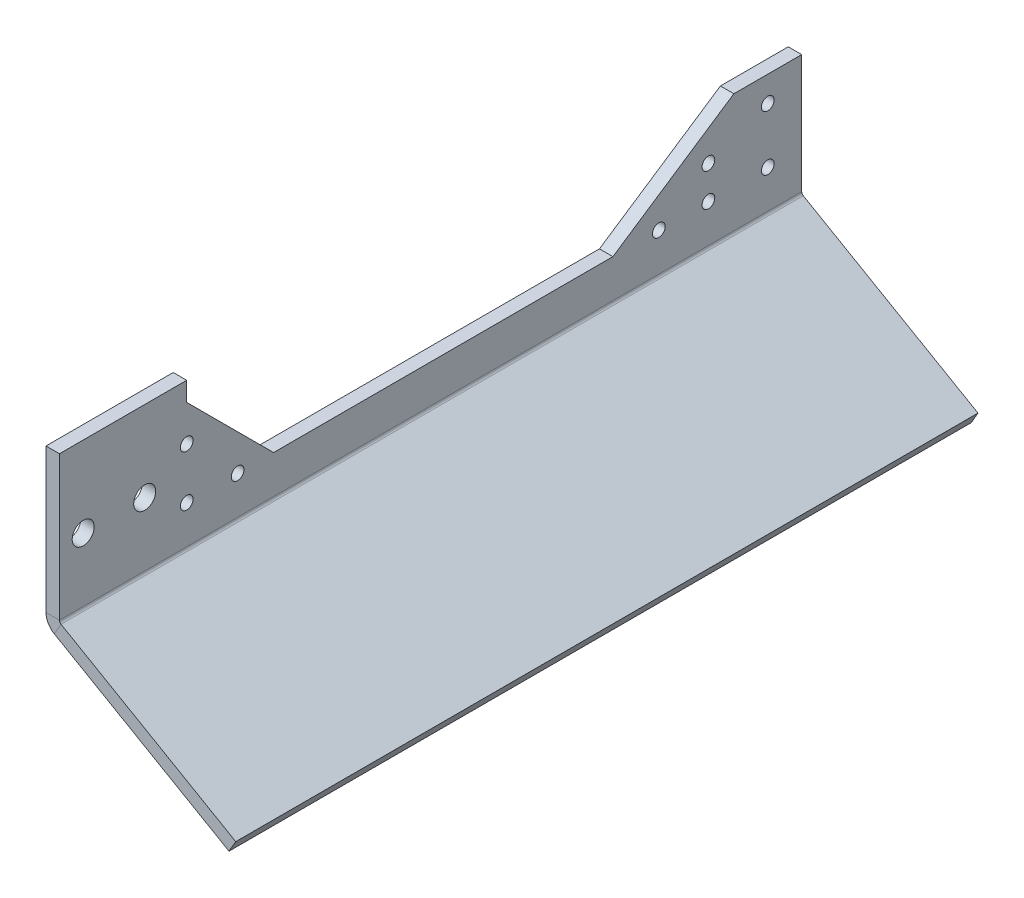
ISO-10303-21;
HEADER;
FILE_DESCRIPTION(('STEP AP214'),'2;1');
FILE_NAME('part.step','',(''),(''),'','','');
FILE_SCHEMA(('AUTOMOTIVE_DESIGN { 1 0 10303 214 1 1 1 1 }'));
ENDSEC;
DATA;
#1=APPLICATION_CONTEXT('core data for automotive mechanical design processes');
#2=APPLICATION_PROTOCOL_DEFINITION('international standard','automotive_design',2000,#1);
#3=PRODUCT_CONTEXT('',#1,'mechanical');
#4=PRODUCT('Part','Part','',(#3));
#5=PRODUCT_RELATED_PRODUCT_CATEGORY('part','',(#4));
#6=PRODUCT_DEFINITION_FORMATION('','',#4);
#7=PRODUCT_DEFINITION_CONTEXT('part definition',#1,'design');
#8=PRODUCT_DEFINITION('design','',#6,#7);
#9=PRODUCT_DEFINITION_SHAPE('','',#8);
#10=(LENGTH_UNIT() NAMED_UNIT(*) SI_UNIT(.MILLI.,.METRE.));
#11=(NAMED_UNIT(*) PLANE_ANGLE_UNIT() SI_UNIT($,.RADIAN.));
#12=(NAMED_UNIT(*) SI_UNIT($,.STERADIAN.) SOLID_ANGLE_UNIT());
#13=UNCERTAINTY_MEASURE_WITH_UNIT(LENGTH_MEASURE(1.E-05),#10,'distance_accuracy_value','');
#14=(GEOMETRIC_REPRESENTATION_CONTEXT(3) GLOBAL_UNCERTAINTY_ASSIGNED_CONTEXT((#13)) GLOBAL_UNIT_ASSIGNED_CONTEXT((#10,
#11,#12)) REPRESENTATION_CONTEXT('',''));
#15=CARTESIAN_POINT('',(0.,0.,0.));
#16=DIRECTION('',(0.,0.,1.));
#17=DIRECTION('',(1.,0.,0.));
#18=AXIS2_PLACEMENT_3D('',#15,#16,#17);
#19=CARTESIAN_POINT('',(1.43557444879162,0.578981601940387,0.));
#20=DIRECTION('',(0.499999999999998,0.86602540378444,0.));
#21=DIRECTION('',(0.,0.,-1.));
#22=AXIS2_PLACEMENT_3D('',#19,#20,#21);
#23=PLANE('',#22);
#24=DIRECTION('',(-0.86602540378444,0.499999999999998,0.));
#25=VECTOR('',#24,1.);
#26=CARTESIAN_POINT('',(44.7368446380136,-24.4210183980595,-160.884918300919));
#27=LINE('',#26,#25);
#28=CARTESIAN_POINT('',(44.7368446380136,-24.4210183980595,-160.884918300919));
#29=VERTEX_POINT('',#28);
#30=CARTESIAN_POINT('',(3.5433,-0.637914312427618,-160.884918300919));
#31=VERTEX_POINT('',#30);
#32=EDGE_CURVE('E44',#29,#31,#27,.T.);
#33=ORIENTED_EDGE('',*,*,#32,.T.);
#34=DIRECTION('',(0.,0.,1.));
#35=VECTOR('',#34,1.);
#36=CARTESIAN_POINT('',(3.5433,-0.637914312427617,0.));
#37=LINE('',#36,#35);
#38=CARTESIAN_POINT('',(3.5433,-0.637914312427615,14.1150816990808));
#39=VERTEX_POINT('',#38);
#40=EDGE_CURVE('E102',#31,#39,#37,.T.);
#41=ORIENTED_EDGE('',*,*,#40,.T.);
#42=DIRECTION('',(0.86602540378444,-0.499999999999998,0.));
#43=VECTOR('',#42,1.);
#44=CARTESIAN_POINT('',(-28.0092892798793,17.5789816019403,14.1150816990808));
#45=LINE('',#44,#43);
#46=CARTESIAN_POINT('',(44.7368446380136,-24.4210183980595,14.1150816990808));
#47=VERTEX_POINT('',#46);
#48=EDGE_CURVE('E89',#39,#47,#45,.T.);
#49=ORIENTED_EDGE('',*,*,#48,.T.);
#50=DIRECTION('',(0.,0.,-1.));
#51=VECTOR('',#50,1.);
#52=CARTESIAN_POINT('',(44.7368446380136,-24.4210183980595,14.1150816990808));
#53=LINE('',#52,#51);
#54=EDGE_CURVE('E65',#47,#29,#53,.T.);
#55=ORIENTED_EDGE('',*,*,#54,.T.);
#56=EDGE_LOOP('',(#33,#41,#49,#55));
#57=FACE_BOUND('',#56,.T.);
#58=ADVANCED_FACE('F40',(#57),#23,.T.);
#59=CARTESIAN_POINT('',(-0.15192555120837,-2.17064905507521,0.));
#60=DIRECTION('',(0.499999999999998,0.86602540378444,0.));
#61=DIRECTION('',(0.,0.,-1.));
#62=AXIS2_PLACEMENT_3D('',#59,#60,#61);
#63=PLANE('',#62);
#64=DIRECTION('',(0.,0.,1.));
#65=VECTOR('',#64,1.);
#66=CARTESIAN_POINT('',(1.95580000000001,-3.38754496944321,0.));
#67=LINE('',#66,#65);
#68=CARTESIAN_POINT('',(1.95580000000001,-3.38754496944321,-160.884918300919));
#69=VERTEX_POINT('',#68);
#70=CARTESIAN_POINT('',(1.95580000000001,-3.38754496944321,14.1150816990808));
#71=VERTEX_POINT('',#70);
#72=EDGE_CURVE('E49',#69,#71,#67,.T.);
#73=ORIENTED_EDGE('',*,*,#72,.F.);
#74=DIRECTION('',(-0.86602540378444,0.499999999999998,0.));
#75=VECTOR('',#74,1.);
#76=CARTESIAN_POINT('',(-24.4006368571727,11.8293509449247,-160.884918300919));
#77=LINE('',#76,#75);
#78=CARTESIAN_POINT('',(43.1493446380136,-27.1706490550751,-160.884918300919));
#79=VERTEX_POINT('',#78);
#80=EDGE_CURVE('E79',#79,#69,#77,.T.);
#81=ORIENTED_EDGE('',*,*,#80,.F.);
#82=DIRECTION('',(0.,0.,-1.));
#83=VECTOR('',#82,1.);
#84=CARTESIAN_POINT('',(43.1493446380136,-27.1706490550751,14.1150816990808));
#85=LINE('',#84,#83);
#86=CARTESIAN_POINT('',(43.1493446380136,-27.1706490550751,14.1150816990808));
#87=VERTEX_POINT('',#86);
#88=EDGE_CURVE('E83',#87,#79,#85,.T.);
#89=ORIENTED_EDGE('',*,*,#88,.F.);
#90=DIRECTION('',(0.86602540378444,-0.499999999999998,0.));
#91=VECTOR('',#90,1.);
#92=CARTESIAN_POINT('',(-0.15192555120837,-2.17064905507521,14.1150816990808));
#93=LINE('',#92,#91);
#94=EDGE_CURVE('E98',#71,#87,#93,.T.);
#95=ORIENTED_EDGE('',*,*,#94,.F.);
#96=EDGE_LOOP('',(#73,#81,#89,#95));
#97=FACE_BOUND('',#96,.T.);
#98=ADVANCED_FACE('F81',(#97),#63,.F.);
#99=CARTESIAN_POINT('',(1.43557444879162,0.578981601940387,14.1150816990808));
#100=DIRECTION('',(0.,0.,-1.));
#101=DIRECTION('',(-0.86602540378444,0.499999999999998,0.));
#102=AXIS2_PLACEMENT_3D('',#99,#100,#101);
#103=PLANE('',#102);
#104=DIRECTION('',(0.499999999999998,0.86602540378444,0.));
#105=VECTOR('',#104,1.);
#106=CARTESIAN_POINT('',(3.5433,-0.637914312427617,14.1150816990808));
#107=LINE('',#106,#105);
#108=EDGE_CURVE('E12',#71,#39,#107,.T.);
#109=ORIENTED_EDGE('',*,*,#108,.F.);
#110=ORIENTED_EDGE('',*,*,#94,.T.);
#111=DIRECTION('',(-0.499999999999998,-0.86602540378444,0.));
#112=VECTOR('',#111,1.);
#113=CARTESIAN_POINT('',(44.7368446380136,-24.4210183980595,14.1150816990808));
#114=LINE('',#113,#112);
#115=EDGE_CURVE('E97',#47,#87,#114,.T.);
#116=ORIENTED_EDGE('',*,*,#115,.F.);
#117=ORIENTED_EDGE('',*,*,#48,.F.);
#118=EDGE_LOOP('',(#109,#110,#116,#117));
#119=FACE_BOUND('',#118,.T.);
#120=ADVANCED_FACE('F42',(#119),#103,.F.);
#121=CARTESIAN_POINT('',(44.7368446380136,-24.4210183980595,14.1150816990808));
#122=DIRECTION('',(-0.86602540378444,0.499999999999998,0.));
#123=DIRECTION('',(0.,0.,1.));
#124=AXIS2_PLACEMENT_3D('',#121,#122,#123);
#125=PLANE('',#124);
#126=ORIENTED_EDGE('',*,*,#88,.T.);
#127=DIRECTION('',(-0.499999999999998,-0.86602540378444,0.));
#128=VECTOR('',#127,1.);
#129=CARTESIAN_POINT('',(44.7368446380136,-24.4210183980595,-160.884918300919));
#130=LINE('',#129,#128);
#131=EDGE_CURVE('E94',#29,#79,#130,.T.);
#132=ORIENTED_EDGE('',*,*,#131,.F.);
#133=ORIENTED_EDGE('',*,*,#54,.F.);
#134=ORIENTED_EDGE('',*,*,#115,.T.);
#135=EDGE_LOOP('',(#126,#132,#133,#134));
#136=FACE_BOUND('',#135,.T.);
#137=ADVANCED_FACE('F93',(#136),#125,.F.);
#138=CARTESIAN_POINT('',(-22.8131368571727,14.5789816019403,-160.884918300919));
#139=DIRECTION('',(0.,0.,1.));
#140=DIRECTION('',(0.499999999999998,0.86602540378444,0.));
#141=AXIS2_PLACEMENT_3D('',#138,#139,#140);
#142=PLANE('',#141);
#143=DIRECTION('',(-0.499999999999998,-0.86602540378444,0.));
#144=VECTOR('',#143,1.);
#145=CARTESIAN_POINT('',(3.5433,-0.637914312427617,-160.884918300919));
#146=LINE('',#145,#144);
#147=EDGE_CURVE('E108',#31,#69,#146,.T.);
#148=ORIENTED_EDGE('',*,*,#147,.F.);
#149=ORIENTED_EDGE('',*,*,#32,.F.);
#150=ORIENTED_EDGE('',*,*,#131,.T.);
#151=ORIENTED_EDGE('',*,*,#80,.T.);
#152=EDGE_LOOP('',(#148,#149,#150,#151));
#153=FACE_BOUND('',#152,.T.);
#154=ADVANCED_FACE('F100',(#153),#142,.F.);
#155=CARTESIAN_POINT('',(3.175,16.7921072428128,-138.88491830092));
#156=DIRECTION('',(-1.,0.,0.));
#157=DIRECTION('',(0.,0.,1.));
#158=AXIS2_PLACEMENT_3D('',#155,#156,#157);
#159=CYLINDRICAL_SURFACE('',#158,1.5);
#160=CARTESIAN_POINT('',(3.175,16.7921072428128,-138.88491830092));
#161=DIRECTION('',(1.,0.,0.));
#162=DIRECTION('',(0.,0.,-1.));
#163=AXIS2_PLACEMENT_3D('',#160,#161,#162);
#164=CIRCLE('',#163,1.5);
#165=CARTESIAN_POINT('',(3.175,16.7921072428128,-140.38491830092));
#166=VERTEX_POINT('',#165);
#167=EDGE_CURVE('E117',#166,#166,#164,.T.);
#168=ORIENTED_EDGE('',*,*,#167,.T.);
#169=EDGE_LOOP('',(#168));
#170=FACE_BOUND('',#169,.T.);
#171=CARTESIAN_POINT('',(0.,16.7921072428128,-138.88491830092));
#172=DIRECTION('',(1.,0.,0.));
#173=DIRECTION('',(0.,0.,-1.));
#174=AXIS2_PLACEMENT_3D('',#171,#172,#173);
#175=CIRCLE('',#174,1.5);
#176=CARTESIAN_POINT('',(0.,16.7921072428128,-140.38491830092));
#177=VERTEX_POINT('',#176);
#178=EDGE_CURVE('E240',#177,#177,#175,.T.);
#179=ORIENTED_EDGE('',*,*,#178,.F.);
#180=EDGE_LOOP('',(#179));
#181=FACE_BOUND('',#180,.T.);
#182=ADVANCED_FACE('F376',(#170,#181),#159,.F.);
#183=CARTESIAN_POINT('',(3.175,9.,-138.88491830092));
#184=DIRECTION('',(-1.,0.,0.));
#185=DIRECTION('',(0.,0.,1.));
#186=AXIS2_PLACEMENT_3D('',#183,#184,#185);
#187=CYLINDRICAL_SURFACE('',#186,1.5);
#188=CARTESIAN_POINT('',(3.175,9.,-138.88491830092));
#189=DIRECTION('',(1.,0.,0.));
#190=DIRECTION('',(0.,0.,-1.));
#191=AXIS2_PLACEMENT_3D('',#188,#189,#190);
#192=CIRCLE('',#191,1.5);
#193=CARTESIAN_POINT('',(3.175,9.,-140.38491830092));
#194=VERTEX_POINT('',#193);
#195=EDGE_CURVE('E120',#194,#194,#192,.T.);
#196=ORIENTED_EDGE('',*,*,#195,.T.);
#197=EDGE_LOOP('',(#196));
#198=FACE_BOUND('',#197,.T.);
#199=CARTESIAN_POINT('',(0.,9.,-138.88491830092));
#200=DIRECTION('',(1.,0.,0.));
#201=DIRECTION('',(0.,0.,-1.));
#202=AXIS2_PLACEMENT_3D('',#199,#200,#201);
#203=CIRCLE('',#202,1.5);
#204=CARTESIAN_POINT('',(0.,9.,-140.38491830092));
#205=VERTEX_POINT('',#204);
#206=EDGE_CURVE('E234',#205,#205,#203,.T.);
#207=ORIENTED_EDGE('',*,*,#206,.F.);
#208=EDGE_LOOP('',(#207));
#209=FACE_BOUND('',#208,.T.);
#210=ADVANCED_FACE('F381',(#198,#209),#187,.F.);
#211=CARTESIAN_POINT('',(3.175,8.99999999999999,-15.8849183009192));
#212=DIRECTION('',(-1.,0.,0.));
#213=DIRECTION('',(0.,0.,1.));
#214=AXIS2_PLACEMENT_3D('',#211,#212,#213);
#215=CYLINDRICAL_SURFACE('',#214,1.49999999999978);
#216=CARTESIAN_POINT('',(3.175,8.99999999999999,-15.8849183009192));
#217=DIRECTION('',(1.,0.,0.));
#218=DIRECTION('',(0.,0.,-1.));
#219=AXIS2_PLACEMENT_3D('',#216,#217,#218);
#220=CIRCLE('',#219,1.49999999999978);
#221=CARTESIAN_POINT('',(3.175,8.99999999999999,-17.384918300919));
#222=VERTEX_POINT('',#221);
#223=EDGE_CURVE('E123',#222,#222,#220,.T.);
#224=ORIENTED_EDGE('',*,*,#223,.T.);
#225=EDGE_LOOP('',(#224));
#226=FACE_BOUND('',#225,.T.);
#227=CARTESIAN_POINT('',(0.,8.99999999999999,-15.8849183009192));
#228=DIRECTION('',(1.,0.,0.));
#229=DIRECTION('',(0.,0.,-1.));
#230=AXIS2_PLACEMENT_3D('',#227,#228,#229);
#231=CIRCLE('',#230,1.49999999999978);
#232=CARTESIAN_POINT('',(0.,8.99999999999999,-17.384918300919));
#233=VERTEX_POINT('',#232);
#234=EDGE_CURVE('E228',#233,#233,#231,.T.);
#235=ORIENTED_EDGE('',*,*,#234,.F.);
#236=EDGE_LOOP('',(#235));
#237=FACE_BOUND('',#236,.T.);
#238=ADVANCED_FACE('F404',(#226,#237),#215,.F.);
#239=CARTESIAN_POINT('',(3.175,9.,-152.884918300919));
#240=DIRECTION('',(-1.,0.,0.));
#241=DIRECTION('',(0.,0.,1.));
#242=AXIS2_PLACEMENT_3D('',#239,#240,#241);
#243=CYLINDRICAL_SURFACE('',#242,1.5);
#244=CARTESIAN_POINT('',(3.175,9.,-152.884918300919));
#245=DIRECTION('',(1.,0.,0.));
#246=DIRECTION('',(0.,0.,-1.));
#247=AXIS2_PLACEMENT_3D('',#244,#245,#246);
#248=CIRCLE('',#247,1.5);
#249=CARTESIAN_POINT('',(3.175,9.,-154.384918300919));
#250=VERTEX_POINT('',#249);
#251=EDGE_CURVE('E126',#250,#250,#248,.T.);
#252=ORIENTED_EDGE('',*,*,#251,.T.);
#253=EDGE_LOOP('',(#252));
#254=FACE_BOUND('',#253,.T.);
#255=CARTESIAN_POINT('',(0.,9.,-152.884918300919));
#256=DIRECTION('',(1.,0.,0.));
#257=DIRECTION('',(0.,0.,-1.));
#258=AXIS2_PLACEMENT_3D('',#255,#256,#257);
#259=CIRCLE('',#258,1.5);
#260=CARTESIAN_POINT('',(0.,9.,-154.384918300919));
#261=VERTEX_POINT('',#260);
#262=EDGE_CURVE('E222',#261,#261,#259,.T.);
#263=ORIENTED_EDGE('',*,*,#262,.F.);
#264=EDGE_LOOP('',(#263));
#265=FACE_BOUND('',#264,.T.);
#266=ADVANCED_FACE('F408',(#254,#265),#243,.F.);
#267=CARTESIAN_POINT('',(3.175,22.,-152.884918300919));
#268=DIRECTION('',(-1.,0.,0.));
#269=DIRECTION('',(0.,0.,1.));
#270=AXIS2_PLACEMENT_3D('',#267,#268,#269);
#271=CYLINDRICAL_SURFACE('',#270,1.5);
#272=CARTESIAN_POINT('',(3.175,22.,-152.884918300919));
#273=DIRECTION('',(1.,0.,0.));
#274=DIRECTION('',(0.,0.,-1.));
#275=AXIS2_PLACEMENT_3D('',#272,#273,#274);
#276=CIRCLE('',#275,1.5);
#277=CARTESIAN_POINT('',(3.175,22.,-154.384918300919));
#278=VERTEX_POINT('',#277);
#279=EDGE_CURVE('E129',#278,#278,#276,.T.);
#280=ORIENTED_EDGE('',*,*,#279,.T.);
#281=EDGE_LOOP('',(#280));
#282=FACE_BOUND('',#281,.T.);
#283=CARTESIAN_POINT('',(0.,22.,-152.884918300919));
#284=DIRECTION('',(1.,0.,0.));
#285=DIRECTION('',(0.,0.,-1.));
#286=AXIS2_PLACEMENT_3D('',#283,#284,#285);
#287=CIRCLE('',#286,1.5);
#288=CARTESIAN_POINT('',(0.,22.,-154.384918300919));
#289=VERTEX_POINT('',#288);
#290=EDGE_CURVE('E216',#289,#289,#287,.T.);
#291=ORIENTED_EDGE('',*,*,#290,.F.);
#292=EDGE_LOOP('',(#291));
#293=FACE_BOUND('',#292,.T.);
#294=ADVANCED_FACE('F412',(#282,#293),#271,.F.);
#295=CARTESIAN_POINT('',(3.175,15.,-5.98491830091923));
#296=DIRECTION('',(-1.,0.,0.));
#297=DIRECTION('',(0.,0.,1.));
#298=AXIS2_PLACEMENT_3D('',#295,#296,#297);
#299=CYLINDRICAL_SURFACE('',#298,2.6);
#300=CARTESIAN_POINT('',(3.175,15.,-5.98491830091923));
#301=DIRECTION('',(1.,0.,0.));
#302=DIRECTION('',(0.,0.,-1.));
#303=AXIS2_PLACEMENT_3D('',#300,#301,#302);
#304=CIRCLE('',#303,2.6);
#305=CARTESIAN_POINT('',(3.175,15.,-8.58491830091923));
#306=VERTEX_POINT('',#305);
#307=EDGE_CURVE('E132',#306,#306,#304,.T.);
#308=ORIENTED_EDGE('',*,*,#307,.T.);
#309=EDGE_LOOP('',(#308));
#310=FACE_BOUND('',#309,.T.);
#311=CARTESIAN_POINT('',(0.,15.,-5.98491830091923));
#312=DIRECTION('',(1.,0.,0.));
#313=DIRECTION('',(0.,0.,-1.));
#314=AXIS2_PLACEMENT_3D('',#311,#312,#313);
#315=CIRCLE('',#314,2.6);
#316=CARTESIAN_POINT('',(0.,15.,-8.58491830091923));
#317=VERTEX_POINT('',#316);
#318=EDGE_CURVE('E213',#317,#317,#315,.T.);
#319=ORIENTED_EDGE('',*,*,#318,.F.);
#320=EDGE_LOOP('',(#319));
#321=FACE_BOUND('',#320,.T.);
#322=ADVANCED_FACE('F416',(#310,#321),#299,.F.);
#323=CARTESIAN_POINT('',(3.175,15.,8.51508169908077));
#324=DIRECTION('',(-1.,0.,0.));
#325=DIRECTION('',(0.,0.,1.));
#326=AXIS2_PLACEMENT_3D('',#323,#324,#325);
#327=CYLINDRICAL_SURFACE('',#326,2.6);
#328=CARTESIAN_POINT('',(3.175,15.,8.51508169908077));
#329=DIRECTION('',(1.,0.,0.));
#330=DIRECTION('',(0.,0.,-1.));
#331=AXIS2_PLACEMENT_3D('',#328,#329,#330);
#332=CIRCLE('',#331,2.6);
#333=CARTESIAN_POINT('',(3.175,15.,5.91508169908077));
#334=VERTEX_POINT('',#333);
#335=EDGE_CURVE('E135',#334,#334,#332,.T.);
#336=ORIENTED_EDGE('',*,*,#335,.T.);
#337=EDGE_LOOP('',(#336));
#338=FACE_BOUND('',#337,.T.);
#339=CARTESIAN_POINT('',(0.,15.,8.51508169908077));
#340=DIRECTION('',(1.,0.,0.));
#341=DIRECTION('',(0.,0.,-1.));
#342=AXIS2_PLACEMENT_3D('',#339,#340,#341);
#343=CIRCLE('',#342,2.6);
#344=CARTESIAN_POINT('',(0.,15.,5.91508169908077));
#345=VERTEX_POINT('',#344);
#346=EDGE_CURVE('E219',#345,#345,#343,.T.);
#347=ORIENTED_EDGE('',*,*,#346,.F.);
#348=EDGE_LOOP('',(#347));
#349=FACE_BOUND('',#348,.T.);
#350=ADVANCED_FACE('F420',(#338,#349),#327,.F.);
#351=CARTESIAN_POINT('',(3.175,21.,-15.8849183009192));
#352=DIRECTION('',(-1.,0.,0.));
#353=DIRECTION('',(0.,0.,1.));
#354=AXIS2_PLACEMENT_3D('',#351,#352,#353);
#355=CYLINDRICAL_SURFACE('',#354,1.5);
#356=CARTESIAN_POINT('',(3.175,21.,-15.8849183009192));
#357=DIRECTION('',(1.,0.,0.));
#358=DIRECTION('',(0.,0.,-1.));
#359=AXIS2_PLACEMENT_3D('',#356,#357,#358);
#360=CIRCLE('',#359,1.5);
#361=CARTESIAN_POINT('',(3.175,21.,-17.3849183009192));
#362=VERTEX_POINT('',#361);
#363=EDGE_CURVE('E138',#362,#362,#360,.T.);
#364=ORIENTED_EDGE('',*,*,#363,.T.);
#365=EDGE_LOOP('',(#364));
#366=FACE_BOUND('',#365,.T.);
#367=CARTESIAN_POINT('',(0.,21.,-15.8849183009192));
#368=DIRECTION('',(1.,0.,0.));
#369=DIRECTION('',(0.,0.,-1.));
#370=AXIS2_PLACEMENT_3D('',#367,#368,#369);
#371=CIRCLE('',#370,1.5);
#372=CARTESIAN_POINT('',(0.,21.,-17.3849183009192));
#373=VERTEX_POINT('',#372);
#374=EDGE_CURVE('E225',#373,#373,#371,.T.);
#375=ORIENTED_EDGE('',*,*,#374,.F.);
#376=EDGE_LOOP('',(#375));
#377=FACE_BOUND('',#376,.T.);
#378=ADVANCED_FACE('F424',(#366,#377),#355,.F.);
#379=CARTESIAN_POINT('',(3.175,8.99999999999998,-27.8849183009192));
#380=DIRECTION('',(-1.,0.,0.));
#381=DIRECTION('',(0.,0.,1.));
#382=AXIS2_PLACEMENT_3D('',#379,#380,#381);
#383=CYLINDRICAL_SURFACE('',#382,1.5);
#384=CARTESIAN_POINT('',(3.175,8.99999999999998,-27.8849183009192));
#385=DIRECTION('',(1.,0.,0.));
#386=DIRECTION('',(0.,0.,-1.));
#387=AXIS2_PLACEMENT_3D('',#384,#385,#386);
#388=CIRCLE('',#387,1.5);
#389=CARTESIAN_POINT('',(3.175,8.99999999999998,-29.3849183009192));
#390=VERTEX_POINT('',#389);
#391=EDGE_CURVE('E141',#390,#390,#388,.T.);
#392=ORIENTED_EDGE('',*,*,#391,.T.);
#393=EDGE_LOOP('',(#392));
#394=FACE_BOUND('',#393,.T.);
#395=CARTESIAN_POINT('',(0.,8.99999999999998,-27.8849183009192));
#396=DIRECTION('',(1.,0.,0.));
#397=DIRECTION('',(0.,0.,-1.));
#398=AXIS2_PLACEMENT_3D('',#395,#396,#397);
#399=CIRCLE('',#398,1.5);
#400=CARTESIAN_POINT('',(0.,8.99999999999998,-29.3849183009192));
#401=VERTEX_POINT('',#400);
#402=EDGE_CURVE('E231',#401,#401,#399,.T.);
#403=ORIENTED_EDGE('',*,*,#402,.F.);
#404=EDGE_LOOP('',(#403));
#405=FACE_BOUND('',#404,.T.);
#406=ADVANCED_FACE('F428',(#394,#405),#383,.F.);
#407=CARTESIAN_POINT('',(3.175,9.,-127.190721167732));
#408=DIRECTION('',(-1.,0.,0.));
#409=DIRECTION('',(0.,0.,1.));
#410=AXIS2_PLACEMENT_3D('',#407,#408,#409);
#411=CYLINDRICAL_SURFACE('',#410,1.50000000000003);
#412=CARTESIAN_POINT('',(3.175,9.,-127.190721167732));
#413=DIRECTION('',(1.,0.,0.));
#414=DIRECTION('',(0.,0.,-1.));
#415=AXIS2_PLACEMENT_3D('',#412,#413,#414);
#416=CIRCLE('',#415,1.50000000000003);
#417=CARTESIAN_POINT('',(3.175,9.,-128.690721167732));
#418=VERTEX_POINT('',#417);
#419=EDGE_CURVE('E144',#418,#418,#416,.T.);
#420=ORIENTED_EDGE('',*,*,#419,.T.);
#421=EDGE_LOOP('',(#420));
#422=FACE_BOUND('',#421,.T.);
#423=CARTESIAN_POINT('',(0.,9.,-127.190721167732));
#424=DIRECTION('',(1.,0.,0.));
#425=DIRECTION('',(0.,0.,-1.));
#426=AXIS2_PLACEMENT_3D('',#423,#424,#425);
#427=CIRCLE('',#426,1.50000000000003);
#428=CARTESIAN_POINT('',(0.,9.,-128.690721167732));
#429=VERTEX_POINT('',#428);
#430=EDGE_CURVE('E237',#429,#429,#427,.T.);
#431=ORIENTED_EDGE('',*,*,#430,.F.);
#432=EDGE_LOOP('',(#431));
#433=FACE_BOUND('',#432,.T.);
#434=ADVANCED_FACE('F432',(#422,#433),#411,.F.);
#435=CARTESIAN_POINT('',(3.175,34.,-15.8849183009192));
#436=DIRECTION('',(0.,-1.,0.));
#437=DIRECTION('',(0.,0.,-1.));
#438=AXIS2_PLACEMENT_3D('',#435,#436,#437);
#439=PLANE('',#438);
#440=DIRECTION('',(0.,0.,1.));
#441=VECTOR('',#440,1.);
#442=CARTESIAN_POINT('',(0.,34.,-15.8849183009192));
#443=LINE('',#442,#441);
#444=CARTESIAN_POINT('',(0.,34.,-15.8849183009192));
#445=VERTEX_POINT('',#444);
#446=CARTESIAN_POINT('',(0.,34.,14.1150816990808));
#447=VERTEX_POINT('',#446);
#448=EDGE_CURVE('E147',#445,#447,#443,.T.);
#449=ORIENTED_EDGE('',*,*,#448,.T.);
#450=DIRECTION('',(-1.,0.,0.));
#451=VECTOR('',#450,1.);
#452=CARTESIAN_POINT('',(3.175,34.,14.1150816990808));
#453=LINE('',#452,#451);
#454=CARTESIAN_POINT('',(3.175,34.,14.1150816990808));
#455=VERTEX_POINT('',#454);
#456=EDGE_CURVE('E112',#455,#447,#453,.T.);
#457=ORIENTED_EDGE('',*,*,#456,.F.);
#458=DIRECTION('',(0.,0.,1.));
#459=VECTOR('',#458,1.);
#460=CARTESIAN_POINT('',(3.175,34.,-15.8849183009192));
#461=LINE('',#460,#459);
#462=CARTESIAN_POINT('',(3.175,34.,-15.8849183009192));
#463=VERTEX_POINT('',#462);
#464=EDGE_CURVE('E201',#463,#455,#461,.T.);
#465=ORIENTED_EDGE('',*,*,#464,.F.);
#466=DIRECTION('',(-1.,0.,0.));
#467=VECTOR('',#466,1.);
#468=CARTESIAN_POINT('',(3.175,34.,-15.8849183009192));
#469=LINE('',#468,#467);
#470=EDGE_CURVE('E150',#463,#445,#469,.T.);
#471=ORIENTED_EDGE('',*,*,#470,.T.);
#472=EDGE_LOOP('',(#449,#457,#465,#471));
#473=FACE_BOUND('',#472,.T.);
#474=ADVANCED_FACE('F345',(#473),#439,.F.);
#475=CARTESIAN_POINT('',(3.175,29.4852813742386,-15.8849183009192));
#476=DIRECTION('',(0.,0.,1.));
#477=DIRECTION('',(1.,0.,0.));
#478=AXIS2_PLACEMENT_3D('',#475,#476,#477);
#479=PLANE('',#478);
#480=DIRECTION('',(0.,1.,0.));
#481=VECTOR('',#480,1.);
#482=CARTESIAN_POINT('',(0.,29.4852813742386,-15.8849183009192));
#483=LINE('',#482,#481);
#484=CARTESIAN_POINT('',(0.,29.4852813742386,-15.8849183009192));
#485=VERTEX_POINT('',#484);
#486=EDGE_CURVE('E153',#485,#445,#483,.T.);
#487=ORIENTED_EDGE('',*,*,#486,.T.);
#488=ORIENTED_EDGE('',*,*,#470,.F.);
#489=DIRECTION('',(0.,1.,0.));
#490=VECTOR('',#489,1.);
#491=CARTESIAN_POINT('',(3.175,29.4852813742386,-15.8849183009192));
#492=LINE('',#491,#490);
#493=CARTESIAN_POINT('',(3.175,29.4852813742386,-15.8849183009192));
#494=VERTEX_POINT('',#493);
#495=EDGE_CURVE('E198',#494,#463,#492,.T.);
#496=ORIENTED_EDGE('',*,*,#495,.F.);
#497=DIRECTION('',(-1.,0.,0.));
#498=VECTOR('',#497,1.);
#499=CARTESIAN_POINT('',(3.175,29.4852813742386,-15.8849183009192));
#500=LINE('',#499,#498);
#501=EDGE_CURVE('E156',#494,#485,#500,.T.);
#502=ORIENTED_EDGE('',*,*,#501,.T.);
#503=EDGE_LOOP('',(#487,#488,#496,#502));
#504=FACE_BOUND('',#503,.T.);
#505=ADVANCED_FACE('F341',(#504),#479,.F.);
#506=CARTESIAN_POINT('',(3.175,8.99999999999999,-36.3701996751578));
#507=DIRECTION('',(0.,-0.707106781186548,0.707106781186547));
#508=DIRECTION('',(0.,-0.707106781186547,-0.707106781186548));
#509=AXIS2_PLACEMENT_3D('',#506,#507,#508);
#510=PLANE('',#509);
#511=DIRECTION('',(0.,0.707106781186547,0.707106781186548));
#512=VECTOR('',#511,1.);
#513=CARTESIAN_POINT('',(0.,8.99999999999999,-36.3701996751578));
#514=LINE('',#513,#512);
#515=CARTESIAN_POINT('',(0.,8.99999999999999,-36.3701996751578));
#516=VERTEX_POINT('',#515);
#517=EDGE_CURVE('E159',#516,#485,#514,.T.);
#518=ORIENTED_EDGE('',*,*,#517,.T.);
#519=ORIENTED_EDGE('',*,*,#501,.F.);
#520=DIRECTION('',(0.,0.707106781186547,0.707106781186548));
#521=VECTOR('',#520,1.);
#522=CARTESIAN_POINT('',(3.175,8.99999999999999,-36.3701996751578));
#523=LINE('',#522,#521);
#524=CARTESIAN_POINT('',(3.175,8.99999999999999,-36.3701996751578));
#525=VERTEX_POINT('',#524);
#526=EDGE_CURVE('E195',#525,#494,#523,.T.);
#527=ORIENTED_EDGE('',*,*,#526,.F.);
#528=DIRECTION('',(-1.,0.,0.));
#529=VECTOR('',#528,1.);
#530=CARTESIAN_POINT('',(3.175,8.99999999999999,-36.3701996751578));
#531=LINE('',#530,#529);
#532=EDGE_CURVE('E162',#525,#516,#531,.T.);
#533=ORIENTED_EDGE('',*,*,#532,.T.);
#534=EDGE_LOOP('',(#518,#519,#527,#533));
#535=FACE_BOUND('',#534,.T.);
#536=ADVANCED_FACE('F336',(#535),#510,.F.);
#537=CARTESIAN_POINT('',(3.175,9.,-116.370199675158));
#538=DIRECTION('',(0.,-1.,0.));
#539=DIRECTION('',(0.,0.,-1.));
#540=AXIS2_PLACEMENT_3D('',#537,#538,#539);
#541=PLANE('',#540);
#542=DIRECTION('',(0.,0.,1.));
#543=VECTOR('',#542,1.);
#544=CARTESIAN_POINT('',(0.,9.,-116.370199675158));
#545=LINE('',#544,#543);
#546=CARTESIAN_POINT('',(0.,9.,-116.370199675158));
#547=VERTEX_POINT('',#546);
#548=EDGE_CURVE('E165',#547,#516,#545,.T.);
#549=ORIENTED_EDGE('',*,*,#548,.T.);
#550=ORIENTED_EDGE('',*,*,#532,.F.);
#551=DIRECTION('',(0.,0.,1.));
#552=VECTOR('',#551,1.);
#553=CARTESIAN_POINT('',(3.175,9.,-116.370199675158));
#554=LINE('',#553,#552);
#555=CARTESIAN_POINT('',(3.175,9.,-116.370199675158));
#556=VERTEX_POINT('',#555);
#557=EDGE_CURVE('E192',#556,#525,#554,.T.);
#558=ORIENTED_EDGE('',*,*,#557,.F.);
#559=DIRECTION('',(-1.,0.,0.));
#560=VECTOR('',#559,1.);
#561=CARTESIAN_POINT('',(3.175,9.,-116.370199675158));
#562=LINE('',#561,#560);
#563=EDGE_CURVE('E168',#556,#547,#562,.T.);
#564=ORIENTED_EDGE('',*,*,#563,.T.);
#565=EDGE_LOOP('',(#549,#550,#558,#564));
#566=FACE_BOUND('',#565,.T.);
#567=ADVANCED_FACE('F332',(#566),#541,.F.);
#568=CARTESIAN_POINT('',(3.175,28.,-144.884918300919));
#569=DIRECTION('',(0.,-0.832182440861265,-0.554501925264635));
#570=DIRECTION('',(0.,0.554501925264635,-0.832182440861266));
#571=AXIS2_PLACEMENT_3D('',#568,#569,#570);
#572=PLANE('',#571);
#573=DIRECTION('',(0.,-0.554501925264635,0.832182440861265));
#574=VECTOR('',#573,1.);
#575=CARTESIAN_POINT('',(0.,28.,-144.884918300919));
#576=LINE('',#575,#574);
#577=CARTESIAN_POINT('',(0.,28.,-144.884918300919));
#578=VERTEX_POINT('',#577);
#579=EDGE_CURVE('E171',#578,#547,#576,.T.);
#580=ORIENTED_EDGE('',*,*,#579,.T.);
#581=ORIENTED_EDGE('',*,*,#563,.F.);
#582=DIRECTION('',(0.,-0.554501925264635,0.832182440861265));
#583=VECTOR('',#582,1.);
#584=CARTESIAN_POINT('',(3.175,28.,-144.884918300919));
#585=LINE('',#584,#583);
#586=CARTESIAN_POINT('',(3.175,28.,-144.884918300919));
#587=VERTEX_POINT('',#586);
#588=EDGE_CURVE('E189',#587,#556,#585,.T.);
#589=ORIENTED_EDGE('',*,*,#588,.F.);
#590=DIRECTION('',(-1.,0.,0.));
#591=VECTOR('',#590,1.);
#592=CARTESIAN_POINT('',(3.175,28.,-144.884918300919));
#593=LINE('',#592,#591);
#594=EDGE_CURVE('E174',#587,#578,#593,.T.);
#595=ORIENTED_EDGE('',*,*,#594,.T.);
#596=EDGE_LOOP('',(#580,#581,#589,#595));
#597=FACE_BOUND('',#596,.T.);
#598=ADVANCED_FACE('F358',(#597),#572,.F.);
#599=CARTESIAN_POINT('',(3.175,28.,-160.884918300919));
#600=DIRECTION('',(0.,-1.,0.));
#601=DIRECTION('',(0.,0.,-1.));
#602=AXIS2_PLACEMENT_3D('',#599,#600,#601);
#603=PLANE('',#602);
#604=DIRECTION('',(0.,0.,1.));
#605=VECTOR('',#604,1.);
#606=CARTESIAN_POINT('',(0.,28.,-160.884918300919));
#607=LINE('',#606,#605);
#608=CARTESIAN_POINT('',(0.,28.,-160.884918300919));
#609=VERTEX_POINT('',#608);
#610=EDGE_CURVE('E177',#609,#578,#607,.T.);
#611=ORIENTED_EDGE('',*,*,#610,.T.);
#612=ORIENTED_EDGE('',*,*,#594,.F.);
#613=DIRECTION('',(0.,0.,1.));
#614=VECTOR('',#613,1.);
#615=CARTESIAN_POINT('',(3.175,28.,-160.884918300919));
#616=LINE('',#615,#614);
#617=CARTESIAN_POINT('',(3.175,28.,-160.884918300919));
#618=VERTEX_POINT('',#617);
#619=EDGE_CURVE('E186',#618,#587,#616,.T.);
#620=ORIENTED_EDGE('',*,*,#619,.F.);
#621=DIRECTION('',(-1.,0.,0.));
#622=VECTOR('',#621,1.);
#623=CARTESIAN_POINT('',(3.175,28.,-160.884918300919));
#624=LINE('',#623,#622);
#625=EDGE_CURVE('E180',#618,#609,#624,.T.);
#626=ORIENTED_EDGE('',*,*,#625,.T.);
#627=EDGE_LOOP('',(#611,#612,#620,#626));
#628=FACE_BOUND('',#627,.T.);
#629=ADVANCED_FACE('F291',(#628),#603,.F.);
#630=CARTESIAN_POINT('',(3.175,0.,0.));
#631=DIRECTION('',(1.,0.,0.));
#632=DIRECTION('',(0.,0.,-1.));
#633=AXIS2_PLACEMENT_3D('',#630,#631,#632);
#634=PLANE('',#633);
#635=DIRECTION('',(0.,0.,1.));
#636=VECTOR('',#635,1.);
#637=CARTESIAN_POINT('',(3.175,0.,0.));
#638=LINE('',#637,#636);
#639=CARTESIAN_POINT('',(3.175,0.,-160.884918300919));
#640=VERTEX_POINT('',#639);
#641=CARTESIAN_POINT('',(3.175,0.,14.1150816990808));
#642=VERTEX_POINT('',#641);
#643=EDGE_CURVE('E115',#640,#642,#638,.T.);
#644=ORIENTED_EDGE('',*,*,#643,.F.);
#645=DIRECTION('',(0.,1.,0.));
#646=VECTOR('',#645,1.);
#647=CARTESIAN_POINT('',(3.175,-50.,-160.884918300919));
#648=LINE('',#647,#646);
#649=EDGE_CURVE('E183',#640,#618,#648,.T.);
#650=ORIENTED_EDGE('',*,*,#649,.T.);
#651=ORIENTED_EDGE('',*,*,#619,.T.);
#652=ORIENTED_EDGE('',*,*,#588,.T.);
#653=ORIENTED_EDGE('',*,*,#557,.T.);
#654=ORIENTED_EDGE('',*,*,#526,.T.);
#655=ORIENTED_EDGE('',*,*,#495,.T.);
#656=ORIENTED_EDGE('',*,*,#464,.T.);
#657=DIRECTION('',(0.,-1.,0.));
#658=VECTOR('',#657,1.);
#659=CARTESIAN_POINT('',(3.175,34.,14.1150816990808));
#660=LINE('',#659,#658);
#661=EDGE_CURVE('E204',#455,#642,#660,.T.);
#662=ORIENTED_EDGE('',*,*,#661,.T.);
#663=EDGE_LOOP('',(#644,#650,#651,#652,#653,#654,#655,#656,#662));
#664=FACE_BOUND('',#663,.T.);
#665=ORIENTED_EDGE('',*,*,#419,.F.);
#666=EDGE_LOOP('',(#665));
#667=FACE_BOUND('',#666,.T.);
#668=ORIENTED_EDGE('',*,*,#391,.F.);
#669=EDGE_LOOP('',(#668));
#670=FACE_BOUND('',#669,.T.);
#671=ORIENTED_EDGE('',*,*,#363,.F.);
#672=EDGE_LOOP('',(#671));
#673=FACE_BOUND('',#672,.T.);
#674=ORIENTED_EDGE('',*,*,#335,.F.);
#675=EDGE_LOOP('',(#674));
#676=FACE_BOUND('',#675,.T.);
#677=ORIENTED_EDGE('',*,*,#307,.F.);
#678=EDGE_LOOP('',(#677));
#679=FACE_BOUND('',#678,.T.);
#680=ORIENTED_EDGE('',*,*,#279,.F.);
#681=EDGE_LOOP('',(#680));
#682=FACE_BOUND('',#681,.T.);
#683=ORIENTED_EDGE('',*,*,#251,.F.);
#684=EDGE_LOOP('',(#683));
#685=FACE_BOUND('',#684,.T.);
#686=ORIENTED_EDGE('',*,*,#223,.F.);
#687=EDGE_LOOP('',(#686));
#688=FACE_BOUND('',#687,.T.);
#689=ORIENTED_EDGE('',*,*,#195,.F.);
#690=EDGE_LOOP('',(#689));
#691=FACE_BOUND('',#690,.T.);
#692=ORIENTED_EDGE('',*,*,#167,.F.);
#693=EDGE_LOOP('',(#692));
#694=FACE_BOUND('',#693,.T.);
#695=ADVANCED_FACE('F274',(#664,#667,#670,#673,#676,#679,#682,#685,#688,#691,#694),#634,.T.);
#696=CARTESIAN_POINT('',(3.175,28.,-160.884918300919));
#697=DIRECTION('',(0.,0.,1.));
#698=DIRECTION('',(1.,0.,0.));
#699=AXIS2_PLACEMENT_3D('',#696,#697,#698);
#700=PLANE('',#699);
#701=ORIENTED_EDGE('',*,*,#649,.F.);
#702=DIRECTION('',(-1.,0.,0.));
#703=VECTOR('',#702,1.);
#704=CARTESIAN_POINT('',(3.175,0.,-160.884918300919));
#705=LINE('',#704,#703);
#706=CARTESIAN_POINT('',(0.,0.,-160.884918300919));
#707=VERTEX_POINT('',#706);
#708=EDGE_CURVE('E207',#640,#707,#705,.T.);
#709=ORIENTED_EDGE('',*,*,#708,.T.);
#710=DIRECTION('',(0.,1.,0.));
#711=VECTOR('',#710,1.);
#712=CARTESIAN_POINT('',(0.,28.,-160.884918300919));
#713=LINE('',#712,#711);
#714=EDGE_CURVE('E210',#707,#609,#713,.T.);
#715=ORIENTED_EDGE('',*,*,#714,.T.);
#716=ORIENTED_EDGE('',*,*,#625,.F.);
#717=EDGE_LOOP('',(#701,#709,#715,#716));
#718=FACE_BOUND('',#717,.T.);
#719=ADVANCED_FACE('F280',(#718),#700,.F.);
#720=CARTESIAN_POINT('',(0.,0.,0.));
#721=DIRECTION('',(1.,0.,0.));
#722=DIRECTION('',(0.,0.,-1.));
#723=AXIS2_PLACEMENT_3D('',#720,#721,#722);
#724=PLANE('',#723);
#725=ORIENTED_EDGE('',*,*,#318,.T.);
#726=EDGE_LOOP('',(#725));
#727=FACE_BOUND('',#726,.T.);
#728=ORIENTED_EDGE('',*,*,#290,.T.);
#729=EDGE_LOOP('',(#728));
#730=FACE_BOUND('',#729,.T.);
#731=ORIENTED_EDGE('',*,*,#346,.T.);
#732=EDGE_LOOP('',(#731));
#733=FACE_BOUND('',#732,.T.);
#734=ORIENTED_EDGE('',*,*,#262,.T.);
#735=EDGE_LOOP('',(#734));
#736=FACE_BOUND('',#735,.T.);
#737=ORIENTED_EDGE('',*,*,#374,.T.);
#738=EDGE_LOOP('',(#737));
#739=FACE_BOUND('',#738,.T.);
#740=ORIENTED_EDGE('',*,*,#234,.T.);
#741=EDGE_LOOP('',(#740));
#742=FACE_BOUND('',#741,.T.);
#743=ORIENTED_EDGE('',*,*,#402,.T.);
#744=EDGE_LOOP('',(#743));
#745=FACE_BOUND('',#744,.T.);
#746=ORIENTED_EDGE('',*,*,#206,.T.);
#747=EDGE_LOOP('',(#746));
#748=FACE_BOUND('',#747,.T.);
#749=ORIENTED_EDGE('',*,*,#430,.T.);
#750=EDGE_LOOP('',(#749));
#751=FACE_BOUND('',#750,.T.);
#752=ORIENTED_EDGE('',*,*,#178,.T.);
#753=EDGE_LOOP('',(#752));
#754=FACE_BOUND('',#753,.T.);
#755=ORIENTED_EDGE('',*,*,#714,.F.);
#756=DIRECTION('',(0.,0.,1.));
#757=VECTOR('',#756,1.);
#758=CARTESIAN_POINT('',(0.,0.,0.));
#759=LINE('',#758,#757);
#760=CARTESIAN_POINT('',(0.,0.,14.1150816990808));
#761=VERTEX_POINT('',#760);
#762=EDGE_CURVE('E243',#707,#761,#759,.T.);
#763=ORIENTED_EDGE('',*,*,#762,.T.);
#764=DIRECTION('',(0.,-1.,0.));
#765=VECTOR('',#764,1.);
#766=CARTESIAN_POINT('',(0.,0.,14.1150816990808));
#767=LINE('',#766,#765);
#768=EDGE_CURVE('E246',#447,#761,#767,.T.);
#769=ORIENTED_EDGE('',*,*,#768,.F.);
#770=ORIENTED_EDGE('',*,*,#448,.F.);
#771=ORIENTED_EDGE('',*,*,#486,.F.);
#772=ORIENTED_EDGE('',*,*,#517,.F.);
#773=ORIENTED_EDGE('',*,*,#548,.F.);
#774=ORIENTED_EDGE('',*,*,#579,.F.);
#775=ORIENTED_EDGE('',*,*,#610,.F.);
#776=EDGE_LOOP('',(#755,#763,#769,#770,#771,#772,#773,#774,#775));
#777=FACE_BOUND('',#776,.T.);
#778=ADVANCED_FACE('F355',(#727,#730,#733,#736,#739,#742,#745,#748,#751,#754,#777),#724,.F.);
#779=CARTESIAN_POINT('',(3.175,0.,14.1150816990808));
#780=DIRECTION('',(0.,0.,-1.));
#781=DIRECTION('',(0.,1.,0.));
#782=AXIS2_PLACEMENT_3D('',#779,#780,#781);
#783=PLANE('',#782);
#784=ORIENTED_EDGE('',*,*,#768,.T.);
#785=DIRECTION('',(1.,0.,0.));
#786=VECTOR('',#785,1.);
#787=CARTESIAN_POINT('',(3.175,0.,14.1150816990808));
#788=LINE('',#787,#786);
#789=EDGE_CURVE('E249',#761,#642,#788,.T.);
#790=ORIENTED_EDGE('',*,*,#789,.T.);
#791=ORIENTED_EDGE('',*,*,#661,.F.);
#792=ORIENTED_EDGE('',*,*,#456,.T.);
#793=EDGE_LOOP('',(#784,#790,#791,#792));
#794=FACE_BOUND('',#793,.T.);
#795=ADVANCED_FACE('F348',(#794),#783,.F.);
#796=CARTESIAN_POINT('',(3.9116,0.,-160.884918300919));
#797=DIRECTION('',(0.,0.,1.));
#798=DIRECTION('',(1.,0.,0.));
#799=AXIS2_PLACEMENT_3D('',#796,#797,#798);
#800=PLANE('',#799);
#801=ORIENTED_EDGE('',*,*,#147,.T.);
#802=CARTESIAN_POINT('',(3.9116,0.,-160.884918300919));
#803=DIRECTION('',(0.,0.,-1.));
#804=DIRECTION('',(-1.,0.,0.));
#805=AXIS2_PLACEMENT_3D('',#802,#803,#804);
#806=CIRCLE('',#805,3.9116);
#807=EDGE_CURVE('E258',#69,#707,#806,.T.);
#808=ORIENTED_EDGE('',*,*,#807,.T.);
#809=ORIENTED_EDGE('',*,*,#708,.F.);
#810=CARTESIAN_POINT('',(3.9116,0.,-160.884918300919));
#811=DIRECTION('',(0.,0.,-1.));
#812=DIRECTION('',(-1.,0.,0.));
#813=AXIS2_PLACEMENT_3D('',#810,#811,#812);
#814=CIRCLE('',#813,0.7366);
#815=EDGE_CURVE('E257',#31,#640,#814,.T.);
#816=ORIENTED_EDGE('',*,*,#815,.F.);
#817=EDGE_LOOP('',(#801,#808,#809,#816));
#818=FACE_BOUND('',#817,.T.);
#819=ADVANCED_FACE('F391',(#818),#800,.F.);
#820=CARTESIAN_POINT('',(3.9116,0.,14.1150816990808));
#821=DIRECTION('',(0.,0.,-1.));
#822=DIRECTION('',(-1.,0.,0.));
#823=AXIS2_PLACEMENT_3D('',#820,#821,#822);
#824=PLANE('',#823);
#825=CARTESIAN_POINT('',(3.9116,0.,14.1150816990808));
#826=DIRECTION('',(0.,0.,-1.));
#827=DIRECTION('',(-1.,0.,0.));
#828=AXIS2_PLACEMENT_3D('',#825,#826,#827);
#829=CIRCLE('',#828,3.9116);
#830=EDGE_CURVE('E254',#761,#71,#829,.F.);
#831=ORIENTED_EDGE('',*,*,#830,.T.);
#832=ORIENTED_EDGE('',*,*,#108,.T.);
#833=CARTESIAN_POINT('',(3.9116,0.,14.1150816990808));
#834=DIRECTION('',(0.,0.,1.));
#835=DIRECTION('',(1.,0.,0.));
#836=AXIS2_PLACEMENT_3D('',#833,#834,#835);
#837=CIRCLE('',#836,0.7366);
#838=EDGE_CURVE('E57',#642,#39,#837,.T.);
#839=ORIENTED_EDGE('',*,*,#838,.F.);
#840=ORIENTED_EDGE('',*,*,#789,.F.);
#841=EDGE_LOOP('',(#831,#832,#839,#840));
#842=FACE_BOUND('',#841,.T.);
#843=ADVANCED_FACE('F351',(#842),#824,.F.);
#844=CARTESIAN_POINT('',(3.9116,0.,101.660801348736));
#845=DIRECTION('',(0.,0.,-1.));
#846=DIRECTION('',(-1.,0.,0.));
#847=AXIS2_PLACEMENT_3D('',#844,#845,#846);
#848=CYLINDRICAL_SURFACE('',#847,0.7366);
#849=ORIENTED_EDGE('',*,*,#643,.T.);
#850=ORIENTED_EDGE('',*,*,#838,.T.);
#851=ORIENTED_EDGE('',*,*,#40,.F.);
#852=ORIENTED_EDGE('',*,*,#815,.T.);
#853=EDGE_LOOP('',(#849,#850,#851,#852));
#854=FACE_BOUND('',#853,.T.);
#855=ADVANCED_FACE('F266',(#854),#848,.F.);
#856=CARTESIAN_POINT('',(3.9116,0.,101.660801348736));
#857=DIRECTION('',(0.,0.,-1.));
#858=DIRECTION('',(-1.,0.,0.));
#859=AXIS2_PLACEMENT_3D('',#856,#857,#858);
#860=CYLINDRICAL_SURFACE('',#859,3.9116);
#861=ORIENTED_EDGE('',*,*,#762,.F.);
#862=ORIENTED_EDGE('',*,*,#807,.F.);
#863=ORIENTED_EDGE('',*,*,#72,.T.);
#864=ORIENTED_EDGE('',*,*,#830,.F.);
#865=EDGE_LOOP('',(#861,#862,#863,#864));
#866=FACE_BOUND('',#865,.T.);
#867=ADVANCED_FACE('F353',(#866),#860,.T.);
#868=CLOSED_SHELL('',(#58,#98,#120,#137,#154,#182,#210,#238,#266,#294,#322,#350,#378,#406,#434,
#474,#505,#536,#567,#598,#629,#695,#719,#778,#795,#819,#843,#855,#867));
#869=MANIFOLD_SOLID_BREP('B2',#868);
#870=ADVANCED_BREP_SHAPE_REPRESENTATION('',(#18,#869),#14);
#871=SHAPE_DEFINITION_REPRESENTATION(#9,#870);
ENDSEC;
END-ISO-10303-21;
